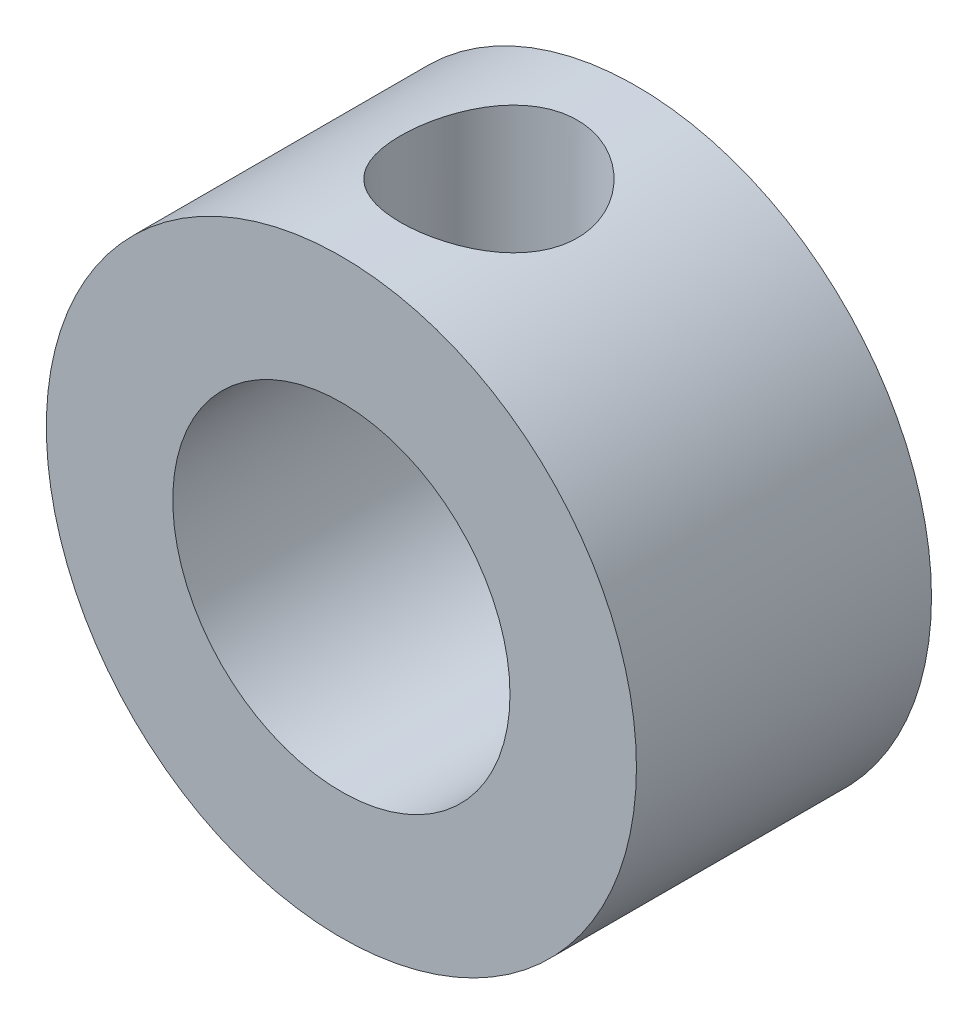
ISO-10303-21;
HEADER;
FILE_DESCRIPTION(('STEP AP214'),'2;1');
FILE_NAME('part.step','',(''),(''),'','','');
FILE_SCHEMA(('AUTOMOTIVE_DESIGN { 1 0 10303 214 1 1 1 1 }'));
ENDSEC;
DATA;
#1=APPLICATION_CONTEXT('core data for automotive mechanical design processes');
#2=APPLICATION_PROTOCOL_DEFINITION('international standard','automotive_design',2000,#1);
#3=PRODUCT_CONTEXT('',#1,'mechanical');
#4=PRODUCT('Part','Part','',(#3));
#5=PRODUCT_RELATED_PRODUCT_CATEGORY('part','',(#4));
#6=PRODUCT_DEFINITION_FORMATION('','',#4);
#7=PRODUCT_DEFINITION_CONTEXT('part definition',#1,'design');
#8=PRODUCT_DEFINITION('design','',#6,#7);
#9=PRODUCT_DEFINITION_SHAPE('','',#8);
#10=(LENGTH_UNIT() NAMED_UNIT(*) SI_UNIT(.MILLI.,.METRE.));
#11=(NAMED_UNIT(*) PLANE_ANGLE_UNIT() SI_UNIT($,.RADIAN.));
#12=(NAMED_UNIT(*) SI_UNIT($,.STERADIAN.) SOLID_ANGLE_UNIT());
#13=UNCERTAINTY_MEASURE_WITH_UNIT(LENGTH_MEASURE(1.E-05),#10,'distance_accuracy_value','');
#14=(GEOMETRIC_REPRESENTATION_CONTEXT(3) GLOBAL_UNCERTAINTY_ASSIGNED_CONTEXT((#13)) GLOBAL_UNIT_ASSIGNED_CONTEXT((#10,
#11,#12)) REPRESENTATION_CONTEXT('',''));
#15=CARTESIAN_POINT('',(0.,0.,0.));
#16=DIRECTION('',(0.,0.,1.));
#17=DIRECTION('',(1.,0.,0.));
#18=AXIS2_PLACEMENT_3D('',#15,#16,#17);
#19=CARTESIAN_POINT('',(0.,0.,7.));
#20=DIRECTION('',(0.,0.,1.));
#21=DIRECTION('',(1.,0.,0.));
#22=AXIS2_PLACEMENT_3D('',#19,#20,#21);
#23=PLANE('',#22);
#24=CARTESIAN_POINT('',(0.,0.,7.));
#25=DIRECTION('',(0.,0.,1.));
#26=DIRECTION('',(1.,0.,0.));
#27=AXIS2_PLACEMENT_3D('',#24,#25,#26);
#28=CIRCLE('',#27,7.);
#29=CARTESIAN_POINT('',(7.,0.,7.));
#30=VERTEX_POINT('',#29);
#31=EDGE_CURVE('E10',#30,#30,#28,.T.);
#32=ORIENTED_EDGE('',*,*,#31,.T.);
#33=EDGE_LOOP('',(#32));
#34=FACE_BOUND('',#33,.T.);
#35=CARTESIAN_POINT('',(0.,0.,7.));
#36=DIRECTION('',(0.,0.,1.));
#37=DIRECTION('',(1.,0.,0.));
#38=AXIS2_PLACEMENT_3D('',#35,#36,#37);
#39=CIRCLE('',#38,4.);
#40=CARTESIAN_POINT('',(4.,0.,7.));
#41=VERTEX_POINT('',#40);
#42=EDGE_CURVE('E46',#41,#41,#39,.T.);
#43=ORIENTED_EDGE('',*,*,#42,.F.);
#44=EDGE_LOOP('',(#43));
#45=FACE_BOUND('',#44,.T.);
#46=ADVANCED_FACE('F34',(#34,#45),#23,.T.);
#47=CARTESIAN_POINT('',(0.,0.,0.));
#48=DIRECTION('',(0.,0.,1.));
#49=DIRECTION('',(1.,0.,0.));
#50=AXIS2_PLACEMENT_3D('',#47,#48,#49);
#51=PLANE('',#50);
#52=CARTESIAN_POINT('',(0.,0.,0.));
#53=DIRECTION('',(0.,0.,1.));
#54=DIRECTION('',(1.,0.,0.));
#55=AXIS2_PLACEMENT_3D('',#52,#53,#54);
#56=CIRCLE('',#55,7.);
#57=CARTESIAN_POINT('',(7.,0.,0.));
#58=VERTEX_POINT('',#57);
#59=EDGE_CURVE('E39',#58,#58,#56,.T.);
#60=ORIENTED_EDGE('',*,*,#59,.F.);
#61=EDGE_LOOP('',(#60));
#62=FACE_BOUND('',#61,.T.);
#63=CARTESIAN_POINT('',(0.,0.,0.));
#64=DIRECTION('',(0.,0.,1.));
#65=DIRECTION('',(1.,0.,0.));
#66=AXIS2_PLACEMENT_3D('',#63,#64,#65);
#67=CIRCLE('',#66,4.);
#68=CARTESIAN_POINT('',(4.,0.,0.));
#69=VERTEX_POINT('',#68);
#70=EDGE_CURVE('E48',#69,#69,#67,.T.);
#71=ORIENTED_EDGE('',*,*,#70,.T.);
#72=EDGE_LOOP('',(#71));
#73=FACE_BOUND('',#72,.T.);
#74=ADVANCED_FACE('F77',(#62,#73),#51,.F.);
#75=CARTESIAN_POINT('',(0.,0.,7.));
#76=DIRECTION('',(0.,0.,-1.));
#77=DIRECTION('',(-1.,0.,0.));
#78=AXIS2_PLACEMENT_3D('',#75,#76,#77);
#79=CYLINDRICAL_SURFACE('',#78,7.);
#80=CARTESIAN_POINT('',(0.,7.,5.59999999999999));
#81=CARTESIAN_POINT('',(-0.115204057854619,6.9999990095077,5.59999860352115));
#82=CARTESIAN_POINT('',(-0.23042224569214,6.99712881971535,5.59048859092644));
#83=CARTESIAN_POINT('',(-0.457503375426832,6.98595947831167,5.55279010408905));
#84=CARTESIAN_POINT('',(-0.569365306175986,6.97765870745569,5.52459605876731));
#85=CARTESIAN_POINT('',(-0.786425790856335,6.95653773502571,5.45055557632562));
#86=CARTESIAN_POINT('',(-0.89163391015352,6.94372420350596,5.40473518253348));
#87=CARTESIAN_POINT('',(-1.09287385347438,6.91490952932704,5.29684946972182));
#88=CARTESIAN_POINT('',(-1.18890445445753,6.89890796268893,5.23478198964641));
#89=CARTESIAN_POINT('',(-1.37182051605724,6.86491032069884,5.09428638953826));
#90=CARTESIAN_POINT('',(-1.45840529974207,6.84687337119851,5.01547672375972));
#91=CARTESIAN_POINT('',(-1.61734889292653,6.81108167894619,4.84454707812574));
#92=CARTESIAN_POINT('',(-1.68970530858417,6.79332698414302,4.75242486302505));
#93=CARTESIAN_POINT('',(-1.8197205281319,6.75967759591281,4.55494094574734));
#94=CARTESIAN_POINT('',(-1.87701232631098,6.74383369329425,4.44932815461296));
#95=CARTESIAN_POINT('',(-1.97289952684664,6.71641068551644,4.22941504407759));
#96=CARTESIAN_POINT('',(-2.01149941887962,6.70483055638635,4.11511681850083));
#97=CARTESIAN_POINT('',(-2.06782287155712,6.68767219173808,3.88445362741736));
#98=CARTESIAN_POINT('',(-2.08610074728548,6.68193497054347,3.76823615859048));
#99=CARTESIAN_POINT('',(-2.1029922286054,6.67663905649674,3.53425358129653));
#100=CARTESIAN_POINT('',(-2.10161059865509,6.677078866648,3.41648885471728));
#101=CARTESIAN_POINT('',(-2.07965768079736,6.68394641694889,3.18726252794812));
#102=CARTESIAN_POINT('',(-2.05978087367759,6.69015744038797,3.07572684949287));
#103=CARTESIAN_POINT('',(-2.00252388597878,6.70751698720074,2.85765229921716));
#104=CARTESIAN_POINT('',(-1.96514197798297,6.71866599785291,2.75111392167594));
#105=CARTESIAN_POINT('',(-1.87342437315154,6.74481826304963,2.54435951047497));
#106=CARTESIAN_POINT('',(-1.81886343708499,6.75987222562333,2.44425008246264));
#107=CARTESIAN_POINT('',(-1.69449311624156,6.7921138180009,2.25437516918573));
#108=CARTESIAN_POINT('',(-1.62468003603623,6.80930196445788,2.16461219882071));
#109=CARTESIAN_POINT('',(-1.46833807071764,6.84475415817112,1.99403933293317));
#110=CARTESIAN_POINT('',(-1.38123287045376,6.86303316034697,1.91375987035847));
#111=CARTESIAN_POINT('',(-1.19456856303955,6.89797141688562,1.76882442231006));
#112=CARTESIAN_POINT('',(-1.09500867260524,6.91463056925774,1.70416942021981));
#113=CARTESIAN_POINT('',(-0.885297053679921,6.94460424097259,1.59199610854938));
#114=CARTESIAN_POINT('',(-0.775078849647127,6.9578956113564,1.5445954772502));
#115=CARTESIAN_POINT('',(-0.547743581844925,6.97946930565111,1.46916057386052));
#116=CARTESIAN_POINT('',(-0.430628452225412,6.98775302661799,1.44112090005452));
#117=CARTESIAN_POINT('',(-0.197333139735663,6.99815710500954,1.40608695094086));
#118=CARTESIAN_POINT('',(-0.0812701366416606,7.00048790584906,1.39837377987775));
#119=CARTESIAN_POINT('',(0.150499448152737,6.99934092538464,1.40219681799692));
#120=CARTESIAN_POINT('',(0.266206075367093,6.9958639194886,1.41373045751203));
#121=CARTESIAN_POINT('',(0.491265047433575,6.98362975782027,1.4551384555561));
#122=CARTESIAN_POINT('',(0.600701881659836,6.9749936171918,1.48459274261322));
#123=CARTESIAN_POINT('',(0.813056494536329,6.95344086978149,1.56050052588949));
#124=CARTESIAN_POINT('',(0.915973487835815,6.94052374849531,1.60695606545301));
#125=CARTESIAN_POINT('',(1.11501206524547,6.91137516091842,1.71675443167359));
#126=CARTESIAN_POINT('',(1.21092135667953,6.89507393161496,1.78046307732718));
#127=CARTESIAN_POINT('',(1.3909326311722,6.86102856270093,1.92251465567393));
#128=CARTESIAN_POINT('',(1.47503164529831,6.84328406203694,2.00086125664271));
#129=CARTESIAN_POINT('',(1.63220042371436,6.80754440616605,2.17334223171712));
#130=CARTESIAN_POINT('',(1.704758737241,6.78956355045859,2.26794662608056));
#131=CARTESIAN_POINT('',(1.83300593101018,6.75607121334564,2.46837911461882));
#132=CARTESIAN_POINT('',(1.88869525361275,6.74055966719185,2.57420691438104));
#133=CARTESIAN_POINT('',(1.9812428597802,6.71394065458417,2.79374548775703));
#134=CARTESIAN_POINT('',(2.01818885711814,6.70281272971451,2.90741666115297));
#135=CARTESIAN_POINT('',(2.07230423141214,6.68628232117816,3.13976315650233));
#136=CARTESIAN_POINT('',(2.08948038570493,6.68087787548571,3.25843674909625));
#137=CARTESIAN_POINT('',(2.1031077827895,6.67659961459091,3.49210612574379));
#138=CARTESIAN_POINT('',(2.1003927743112,6.67746306290276,3.60704911146919));
#139=CARTESIAN_POINT('',(2.07630507622027,6.68499161674532,3.83475974476086));
#140=CARTESIAN_POINT('',(2.05493313374585,6.69165648995131,3.94752747925272));
#141=CARTESIAN_POINT('',(1.9946764432608,6.7098606917247,4.16632355878434));
#142=CARTESIAN_POINT('',(1.95601245709973,6.72133846373454,4.27241820230217));
#143=CARTESIAN_POINT('',(1.86244109969503,6.74786390463686,4.47669941434901));
#144=CARTESIAN_POINT('',(1.80753061948005,6.76291225669556,4.5748844646982));
#145=CARTESIAN_POINT('',(1.68068269327122,6.79556746998737,4.76442836313677));
#146=CARTESIAN_POINT('',(1.60819786530197,6.81324756230006,4.85540826576426));
#147=CARTESIAN_POINT('',(1.44924408481688,6.84881848629347,5.02418349763132));
#148=CARTESIAN_POINT('',(1.36277150398828,6.8667093715328,5.10197539525494));
#149=CARTESIAN_POINT('',(1.17525206705656,6.90131311199101,5.24443277721295));
#150=CARTESIAN_POINT('',(1.07385304010685,6.91797623671995,5.30864802559766));
#151=CARTESIAN_POINT('',(0.861197923576932,6.94764952638087,5.41902923786565));
#152=CARTESIAN_POINT('',(0.749946474198531,6.9606613990348,5.46520364358431));
#153=CARTESIAN_POINT('',(0.533060797717391,6.98043044957033,5.53405338591384));
#154=CARTESIAN_POINT('',(0.428101746735925,6.98770838333498,5.55871634203654));
#155=CARTESIAN_POINT('',(0.215432273323089,6.99749322292286,5.5916889353382));
#156=CARTESIAN_POINT('',(0.107722313801395,7.00000092616635,5.60000130578674));
#157=CARTESIAN_POINT('',(0.,7.,5.59999999999999));
#158=B_SPLINE_CURVE_WITH_KNOTS('',3,(#80,#81,#82,#83,#84,#85,#86,#87,#88,#89,#90,#91,#92,#93,
#94,#95,#96,#97,#98,#99,#100,#101,#102,#103,#104,#105,#106,#107,#108,#109,#110,#111,#112,#113,
#114,#115,#116,#117,#118,#119,#120,#121,#122,#123,#124,#125,#126,#127,#128,#129,#130,#131,#132,
#133,#134,#135,#136,#137,#138,#139,#140,#141,#142,#143,#144,#145,#146,#147,#148,#149,#150,#151,
#152,#153,#154,#155,#156,#157),.UNSPECIFIED.,.T.,.F.,(4,2,2,2,2,2,2,2,2,2,2,2,2,2,2,2,2,2,2,2,2,
2,2,2,2,2,2,2,2,2,2,2,2,2,2,2,2,2,4),(0.,0.345216485057654,0.690535950784397,1.03534714682122,
1.38020423017778,1.73397844127468,2.08781212204086,2.44960073405752,2.81130240360512,
3.16287565099237,3.51436369646724,3.85316423376745,4.191998211212,4.53547397025966,
4.87903304221976,5.23693945667431,5.59486839143498,5.95519465634362,6.31542034940329,
6.66272333213961,7.00997994970455,7.34939445355255,7.68884976431217,8.03615827984069,
8.38355394800265,8.74356560451943,9.1035678195375,9.46186940931749,9.82004813244393,
10.1633021765698,10.5065424753262,10.8455205657019,11.1845635658073,11.5359569595828,
11.8874416486288,12.2492019462572,12.6107927623971,12.9336436870902,13.256440637348),.UNSPECIFIED.);
#159=CARTESIAN_POINT('',(0.,7.,5.59999999999999));
#160=VERTEX_POINT('',#159);
#161=EDGE_CURVE('E51',#160,#160,#158,.T.);
#162=ORIENTED_EDGE('',*,*,#161,.T.);
#163=EDGE_LOOP('',(#162));
#164=FACE_BOUND('',#163,.T.);
#165=ORIENTED_EDGE('',*,*,#31,.F.);
#166=EDGE_LOOP('',(#165));
#167=FACE_BOUND('',#166,.T.);
#168=ORIENTED_EDGE('',*,*,#59,.T.);
#169=EDGE_LOOP('',(#168));
#170=FACE_BOUND('',#169,.T.);
#171=ADVANCED_FACE('F36',(#164,#167,#170),#79,.T.);
#172=CARTESIAN_POINT('',(0.,0.,7.));
#173=DIRECTION('',(0.,0.,-1.));
#174=DIRECTION('',(-1.,0.,0.));
#175=AXIS2_PLACEMENT_3D('',#172,#173,#174);
#176=CYLINDRICAL_SURFACE('',#175,4.);
#177=CARTESIAN_POINT('',(0.,4.,5.59999999999999));
#178=CARTESIAN_POINT('',(-0.109725239522176,3.99999264287857,5.59999149182402));
#179=CARTESIAN_POINT('',(-0.219566121797986,3.99543735627817,5.59134922217853));
#180=CARTESIAN_POINT('',(-0.435956332853302,3.97766056559727,5.55717948516371));
#181=CARTESIAN_POINT('',(-0.542499967026169,3.96442485872988,5.53162434455592));
#182=CARTESIAN_POINT('',(-0.748847767256636,3.93066356262107,5.46492682041998));
#183=CARTESIAN_POINT('',(-0.848677088492019,3.91016722161181,5.42384693196482));
#184=CARTESIAN_POINT('',(-1.0398542926017,3.86372814833453,5.32761268027));
#185=CARTESIAN_POINT('',(-1.13120230734359,3.83778550076629,5.27245853590725));
#186=CARTESIAN_POINT('',(-1.30947182891695,3.78081963010103,5.14560480379001));
#187=CARTESIAN_POINT('',(-1.39572427915895,3.7495762633363,5.07306544943579));
#188=CARTESIAN_POINT('',(-1.55546505007128,3.68618069665244,4.91532568390628));
#189=CARTESIAN_POINT('',(-1.62894256542358,3.65402775386038,4.83011466668523));
#190=CARTESIAN_POINT('',(-1.76753210720386,3.58917602274785,4.64052416418153));
#191=CARTESIAN_POINT('',(-1.83134596949795,3.55667651133239,4.53511911137416));
#192=CARTESIAN_POINT('',(-1.940078009522,3.49855992208216,4.31322101259495));
#193=CARTESIAN_POINT('',(-1.98501055983617,3.47293761465966,4.19673648353417));
#194=CARTESIAN_POINT('',(-2.05162778973322,3.43398312295477,3.9632691019904));
#195=CARTESIAN_POINT('',(-2.07458133375183,3.41998733122417,3.84676509569801));
#196=CARTESIAN_POINT('',(-2.10042065774089,3.40418721984817,3.61079196134464));
#197=CARTESIAN_POINT('',(-2.10333025607271,3.40236843025802,3.49132652193647));
#198=CARTESIAN_POINT('',(-2.08992575686747,3.41060563138389,3.27023585900601));
#199=CARTESIAN_POINT('',(-2.07615752002025,3.4190893964975,3.16838235315366));
#200=CARTESIAN_POINT('',(-2.03424482005422,3.44418916575293,2.96871985136041));
#201=CARTESIAN_POINT('',(-2.00609491145431,3.46080825015501,2.87091240259461));
#202=CARTESIAN_POINT('',(-1.93576201725034,3.50064017337879,2.67933944133553));
#203=CARTESIAN_POINT('',(-1.89327386515966,3.52399463994301,2.58571682638858));
#204=CARTESIAN_POINT('',(-1.79571666755297,3.57469177714186,2.40646125445991));
#205=CARTESIAN_POINT('',(-1.74064200304352,3.60203622704668,2.32083189002303));
#206=CARTESIAN_POINT('',(-1.61039398180521,3.66230444404028,2.14721957759017));
#207=CARTESIAN_POINT('',(-1.53347842501707,3.69546972830905,2.0606227305343));
#208=CARTESIAN_POINT('',(-1.36616462781175,3.76053926987168,1.90094507949335));
#209=CARTESIAN_POINT('',(-1.27575868558247,3.79244279356364,1.82787205014572));
#210=CARTESIAN_POINT('',(-1.07766804032998,3.85356353260701,1.69341787931535));
#211=CARTESIAN_POINT('',(-0.969298919443496,3.88252998474475,1.63292153118831));
#212=CARTESIAN_POINT('',(-0.742023442184859,3.93228772595726,1.53153732928501));
#213=CARTESIAN_POINT('',(-0.623126340783865,3.95308610970455,1.4906324518135));
#214=CARTESIAN_POINT('',(-0.389396974626688,3.9825873442618,1.43322732089386));
#215=CARTESIAN_POINT('',(-0.275130823094222,3.99219507728301,1.4148930907168));
#216=CARTESIAN_POINT('',(-0.0447608666750918,4.00140669767392,1.39730685099086));
#217=CARTESIAN_POINT('',(0.0713418920739022,4.00101608864393,1.39804434338993));
#218=CARTESIAN_POINT('',(0.291279078552977,3.99076728683619,1.41762725788288));
#219=CARTESIAN_POINT('',(0.395299675486035,3.98173859499713,1.43488622954968));
#220=CARTESIAN_POINT('',(0.59872818219623,3.95626547527309,1.4844387504391));
#221=CARTESIAN_POINT('',(0.69813560404272,3.93982026491349,1.51673388605335));
#222=CARTESIAN_POINT('',(0.892553327327724,3.90044221082327,1.59614425381874));
#223=CARTESIAN_POINT('',(0.987382033379108,3.87735176388228,1.64362307426732));
#224=CARTESIAN_POINT('',(1.16801156602731,3.82682103032807,1.75161917503483));
#225=CARTESIAN_POINT('',(1.25380875133066,3.79937900035166,1.81214168451701));
#226=CARTESIAN_POINT('',(1.42355402164766,3.73930849945052,1.95183455389138));
#227=CARTESIAN_POINT('',(1.50635375236175,3.70643824529688,2.03229813881506));
#228=CARTESIAN_POINT('',(1.65784945462857,3.64120206418591,2.20585137885724));
#229=CARTESIAN_POINT('',(1.72653319455466,3.60883659688132,2.298951868959));
#230=CARTESIAN_POINT('',(1.85197407713202,3.54618291275876,2.50233559015912));
#231=CARTESIAN_POINT('',(1.907720584217,3.51615003477916,2.61332823562711));
#232=CARTESIAN_POINT('',(1.99916377433975,3.46498558301669,2.84516122596434));
#233=CARTESIAN_POINT('',(2.03488847416354,3.44384158132139,2.96598753776114));
#234=CARTESIAN_POINT('',(2.08179228794019,3.41567335738197,3.20149049526115));
#235=CARTESIAN_POINT('',(2.09503212797938,3.4074693970288,3.31561103123257));
#236=CARTESIAN_POINT('',(2.10264402498694,3.40278132518373,3.54469308443814));
#237=CARTESIAN_POINT('',(2.09702755352025,3.40629008804561,3.6596540479175));
#238=CARTESIAN_POINT('',(2.06905731966412,3.42333280060867,3.87316961432223));
#239=CARTESIAN_POINT('',(2.04869586578453,3.4356715106149,3.97209433551285));
#240=CARTESIAN_POINT('',(1.99445953447468,3.4674360798436,4.16496081401225));
#241=CARTESIAN_POINT('',(1.96057985676336,3.48686445637592,4.25890078781238));
#242=CARTESIAN_POINT('',(1.8778270800915,3.53215539501753,4.44599660125697));
#243=CARTESIAN_POINT('',(1.82811697206111,3.55835615136984,4.53869769157733));
#244=CARTESIAN_POINT('',(1.71597189148521,3.61377283019222,4.71506230921822));
#245=CARTESIAN_POINT('',(1.65353007488422,3.64299037017672,4.79872093850826));
#246=CARTESIAN_POINT('',(1.50756499361577,3.7059946066124,4.96672364713411));
#247=CARTESIAN_POINT('',(1.42231898680451,3.73985298438168,5.04955350976633));
#248=CARTESIAN_POINT('',(1.2383912708079,3.80472261290781,5.20015739194561));
#249=CARTESIAN_POINT('',(1.13970134446325,3.83573210281286,5.26792213623382));
#250=CARTESIAN_POINT('',(0.928722586410789,3.89224463430732,5.38743364904117));
#251=CARTESIAN_POINT('',(0.816206474636302,3.91762876470986,5.43884301060635));
#252=CARTESIAN_POINT('',(0.641101799511677,3.94873745727715,5.50070791315573));
#253=CARTESIAN_POINT('',(0.581718321049471,3.95794212176884,5.51878135698884));
#254=CARTESIAN_POINT('',(0.461272845180562,3.97377707651405,5.54965439112677));
#255=CARTESIAN_POINT('',(0.400211824286285,3.98040883184999,5.56245698304871));
#256=CARTESIAN_POINT('',(0.282777177199966,3.99038534961525,5.58164251076547));
#257=CARTESIAN_POINT('',(0.226504746010371,3.99398117175069,5.58851710911177));
#258=CARTESIAN_POINT('',(0.113498532604898,3.99879042332403,5.59769809925702));
#259=CARTESIAN_POINT('',(0.0567647413745303,4.00000380609873,5.60000440157989));
#260=CARTESIAN_POINT('',(0.,4.,5.59999999999999));
#261=B_SPLINE_CURVE_WITH_KNOTS('',3,(#177,#178,#179,#180,#181,#182,#183,#184,#185,#186,#187,
#188,#189,#190,#191,#192,#193,#194,#195,#196,#197,#198,#199,#200,#201,#202,#203,#204,#205,#206,
#207,#208,#209,#210,#211,#212,#213,#214,#215,#216,#217,#218,#219,#220,#221,#222,#223,#224,#225,
#226,#227,#228,#229,#230,#231,#232,#233,#234,#235,#236,#237,#238,#239,#240,#241,#242,#243,#244,
#245,#246,#247,#248,#249,#250,#251,#252,#253,#254,#255,#256,#257,#258,#259,#260),.UNSPECIFIED.,
.T.,.F.,(4,2,2,2,2,2,2,2,2,2,2,2,2,2,2,2,2,2,2,2,2,2,2,2,2,2,2,2,2,2,2,2,2,2,2,2,2,2,2,2,2,4),
(0.,0.328955388056857,0.658450355809532,0.986632826787795,1.31481019432104,1.66422610127769,
2.01393612903032,2.3943054227538,2.77438464995627,3.13089429519634,3.48698022433371,
3.79492330354658,4.1029830689429,4.41806287071791,4.73328360921355,5.09317488258759,
5.45327241364169,5.83355153918035,6.21349962504737,6.55994297045683,6.90619561978192,
7.2222202700175,7.53827827001647,7.8625561182731,8.18696421086292,8.54557019619713,
8.90448561862084,9.28577946390599,9.66653841880975,10.0100186118085,10.3532898805347,
10.6572136356427,10.9612454093543,11.2851996834104,11.6093285635883,11.9784125341219,
12.347723115996,12.7242211787441,12.9122308814786,13.1001333688401,13.2703102751049,
13.4404905144748),.UNSPECIFIED.);
#262=CARTESIAN_POINT('',(0.,4.,5.59999999999999));
#263=VERTEX_POINT('',#262);
#264=EDGE_CURVE('E60',#263,#263,#261,.T.);
#265=ORIENTED_EDGE('',*,*,#264,.F.);
#266=EDGE_LOOP('',(#265));
#267=FACE_BOUND('',#266,.T.);
#268=ORIENTED_EDGE('',*,*,#42,.T.);
#269=EDGE_LOOP('',(#268));
#270=FACE_BOUND('',#269,.T.);
#271=ORIENTED_EDGE('',*,*,#70,.F.);
#272=EDGE_LOOP('',(#271));
#273=FACE_BOUND('',#272,.T.);
#274=ADVANCED_FACE('F68',(#267,#270,#273),#176,.F.);
#275=CARTESIAN_POINT('',(0.,7.,3.5));
#276=DIRECTION('',(0.,1.,0.));
#277=DIRECTION('',(0.,0.,1.));
#278=AXIS2_PLACEMENT_3D('',#275,#276,#277);
#279=CYLINDRICAL_SURFACE('',#278,2.09999999999999);
#280=ORIENTED_EDGE('',*,*,#264,.T.);
#281=EDGE_LOOP('',(#280));
#282=FACE_BOUND('',#281,.T.);
#283=ORIENTED_EDGE('',*,*,#161,.F.);
#284=EDGE_LOOP('',(#283));
#285=FACE_BOUND('',#284,.T.);
#286=ADVANCED_FACE('F65',(#282,#285),#279,.F.);
#287=CLOSED_SHELL('',(#46,#74,#171,#274,#286));
#288=MANIFOLD_SOLID_BREP('B2',#287);
#289=ADVANCED_BREP_SHAPE_REPRESENTATION('',(#18,#288),#14);
#290=SHAPE_DEFINITION_REPRESENTATION(#9,#289);
ENDSEC;
END-ISO-10303-21;
